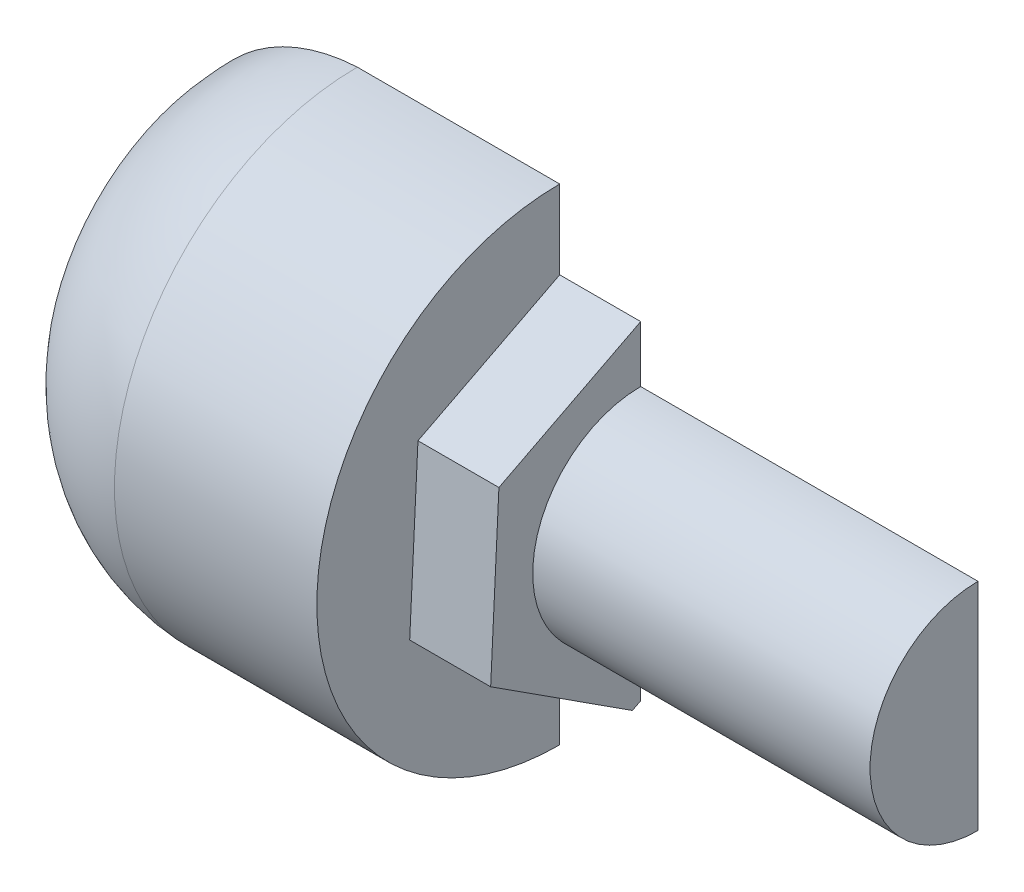
ISO-10303-21;
HEADER;
FILE_DESCRIPTION(('STEP AP214'),'2;1');
FILE_NAME('part.step','',(''),(''),'','','');
FILE_SCHEMA(('AUTOMOTIVE_DESIGN { 1 0 10303 214 1 1 1 1 }'));
ENDSEC;
DATA;
#1=APPLICATION_CONTEXT('core data for automotive mechanical design processes');
#2=APPLICATION_PROTOCOL_DEFINITION('international standard','automotive_design',2000,#1);
#3=PRODUCT_CONTEXT('',#1,'mechanical');
#4=PRODUCT('Part','Part','',(#3));
#5=PRODUCT_RELATED_PRODUCT_CATEGORY('part','',(#4));
#6=PRODUCT_DEFINITION_FORMATION('','',#4);
#7=PRODUCT_DEFINITION_CONTEXT('part definition',#1,'design');
#8=PRODUCT_DEFINITION('design','',#6,#7);
#9=PRODUCT_DEFINITION_SHAPE('','',#8);
#10=(LENGTH_UNIT() NAMED_UNIT(*) SI_UNIT(.MILLI.,.METRE.));
#11=(NAMED_UNIT(*) PLANE_ANGLE_UNIT() SI_UNIT($,.RADIAN.));
#12=(NAMED_UNIT(*) SI_UNIT($,.STERADIAN.) SOLID_ANGLE_UNIT());
#13=UNCERTAINTY_MEASURE_WITH_UNIT(LENGTH_MEASURE(1.E-05),#10,'distance_accuracy_value','');
#14=(GEOMETRIC_REPRESENTATION_CONTEXT(3) GLOBAL_UNCERTAINTY_ASSIGNED_CONTEXT((#13)) GLOBAL_UNIT_ASSIGNED_CONTEXT((#10,
#11,#12)) REPRESENTATION_CONTEXT('',''));
#15=CARTESIAN_POINT('',(0.,0.,0.));
#16=DIRECTION('',(0.,0.,1.));
#17=DIRECTION('',(1.,0.,0.));
#18=AXIS2_PLACEMENT_3D('',#15,#16,#17);
#19=CARTESIAN_POINT('',(0.,18.,0.));
#20=DIRECTION('',(-1.,0.,0.));
#21=DIRECTION('',(0.,0.,1.));
#22=AXIS2_PLACEMENT_3D('',#19,#20,#21);
#23=PLANE('',#22);
#24=DIRECTION('',(0.,-1.,0.));
#25=VECTOR('',#24,1.);
#26=CARTESIAN_POINT('',(0.,18.,0.));
#27=LINE('',#26,#25);
#28=CARTESIAN_POINT('',(0.,18.,0.));
#29=VERTEX_POINT('',#28);
#30=CARTESIAN_POINT('',(0.,12.1695229778633,0.));
#31=VERTEX_POINT('',#30);
#32=EDGE_CURVE('E209',#29,#31,#27,.T.);
#33=ORIENTED_EDGE('',*,*,#32,.F.);
#34=CARTESIAN_POINT('',(0.,0.,0.));
#35=DIRECTION('',(-1.,0.,0.));
#36=DIRECTION('',(0.,0.,1.));
#37=AXIS2_PLACEMENT_3D('',#34,#35,#36);
#38=CIRCLE('',#37,18.);
#39=CARTESIAN_POINT('',(0.,-18.,0.));
#40=VERTEX_POINT('',#39);
#41=EDGE_CURVE('E178',#40,#29,#38,.T.);
#42=ORIENTED_EDGE('',*,*,#41,.F.);
#43=CARTESIAN_POINT('',(0.,-12.1695229778633,0.));
#44=VERTEX_POINT('',#43);
#45=EDGE_CURVE('E225',#44,#40,#27,.T.);
#46=ORIENTED_EDGE('',*,*,#45,.F.);
#47=DIRECTION('',(0.,0.45690168699327,-0.889517199621628));
#48=VECTOR('',#47,1.);
#49=CARTESIAN_POINT('',(0.,-12.4845754630742,0.613358655387881));
#50=LINE('',#49,#48);
#51=CARTESIAN_POINT('',(0.,-12.4845754630742,0.613358655387879));
#52=VERTEX_POINT('',#51);
#53=EDGE_CURVE('E58',#52,#44,#50,.T.);
#54=ORIENTED_EDGE('',*,*,#53,.F.);
#55=DIRECTION('',(0.,-0.541893648478888,-0.840447067778952));
#56=VECTOR('',#55,1.);
#57=CARTESIAN_POINT('',(0.,-5.71110355434015,11.1186388341801));
#58=LINE('',#57,#56);
#59=CARTESIAN_POINT('',(0.,-5.71110355434015,11.1186388341801));
#60=VERTEX_POINT('',#59);
#61=EDGE_CURVE('E143',#60,#52,#58,.T.);
#62=ORIENTED_EDGE('',*,*,#61,.F.);
#63=DIRECTION('',(0.,-0.998795335472159,0.0490701318426758));
#64=VECTOR('',#63,1.);
#65=CARTESIAN_POINT('',(0.,6.77347190873408,10.5052801787922));
#66=LINE('',#65,#64);
#67=CARTESIAN_POINT('',(0.,6.77347190873408,10.5052801787922));
#68=VERTEX_POINT('',#67);
#69=EDGE_CURVE('E155',#68,#60,#66,.T.);
#70=ORIENTED_EDGE('',*,*,#69,.F.);
#71=DIRECTION('',(0.,-0.456901686993271,0.889517199621628));
#72=VECTOR('',#71,1.);
#73=CARTESIAN_POINT('',(0.,12.4845754630742,-0.613358655387877));
#74=LINE('',#73,#72);
#75=EDGE_CURVE('E164',#31,#68,#74,.T.);
#76=ORIENTED_EDGE('',*,*,#75,.F.);
#77=EDGE_LOOP('',(#33,#42,#46,#54,#62,#70,#76));
#78=FACE_BOUND('',#77,.T.);
#79=ADVANCED_FACE('F36',(#78),#23,.F.);
#80=CARTESIAN_POINT('',(-14.3013165100804,0.,0.));
#81=DIRECTION('',(-1.,0.,0.));
#82=DIRECTION('',(0.,0.,1.));
#83=AXIS2_PLACEMENT_3D('',#80,#81,#82);
#84=DEGENERATE_TOROIDAL_SURFACE('',#83,4.10263302016069,13.9149188855492,.T.);
#85=CARTESIAN_POINT('',(-14.3013165100804,-4.10263302016069,0.));
#86=DIRECTION('',(0.,0.,-1.));
#87=DIRECTION('',(-1.,0.,0.));
#88=AXIS2_PLACEMENT_3D('',#85,#86,#87);
#89=CIRCLE('',#88,13.9149188855492);
#90=CARTESIAN_POINT('',(-15.0000000000001,-18.,0.));
#91=VERTEX_POINT('',#90);
#92=CARTESIAN_POINT('',(-25.,-13.,0.));
#93=VERTEX_POINT('',#92);
#94=EDGE_CURVE('E201',#91,#93,#89,.T.);
#95=ORIENTED_EDGE('',*,*,#94,.F.);
#96=CARTESIAN_POINT('',(-15.0000000000001,0.,0.));
#97=DIRECTION('',(-1.,0.,0.));
#98=DIRECTION('',(0.,0.,1.));
#99=AXIS2_PLACEMENT_3D('',#96,#97,#98);
#100=CIRCLE('',#99,18.);
#101=CARTESIAN_POINT('',(-15.0000000000001,18.,0.));
#102=VERTEX_POINT('',#101);
#103=EDGE_CURVE('E175',#91,#102,#100,.T.);
#104=ORIENTED_EDGE('',*,*,#103,.T.);
#105=CARTESIAN_POINT('',(-14.3013165100804,4.10263302016069,0.));
#106=DIRECTION('',(0.,0.,-1.));
#107=DIRECTION('',(-1.,0.,0.));
#108=AXIS2_PLACEMENT_3D('',#105,#106,#107);
#109=CIRCLE('',#108,13.9149188855492);
#110=CARTESIAN_POINT('',(-25.,13.,0.));
#111=VERTEX_POINT('',#110);
#112=EDGE_CURVE('E203',#111,#102,#109,.T.);
#113=ORIENTED_EDGE('',*,*,#112,.F.);
#114=CARTESIAN_POINT('',(-25.,0.,0.));
#115=DIRECTION('',(-1.,0.,0.));
#116=DIRECTION('',(0.,0.,1.));
#117=AXIS2_PLACEMENT_3D('',#114,#115,#116);
#118=CIRCLE('',#117,13.);
#119=EDGE_CURVE('E150',#93,#111,#118,.T.);
#120=ORIENTED_EDGE('',*,*,#119,.F.);
#121=EDGE_LOOP('',(#95,#104,#113,#120));
#122=FACE_BOUND('',#121,.T.);
#123=ADVANCED_FACE('F38',(#122),#84,.T.);
#124=CARTESIAN_POINT('',(-25.,0.,0.));
#125=DIRECTION('',(-1.,0.,0.));
#126=DIRECTION('',(0.,0.,1.));
#127=AXIS2_PLACEMENT_3D('',#124,#125,#126);
#128=CONICAL_SURFACE('',#127,13.,1.00963291450654);
#129=DIRECTION('',(-0.53217154521835,-0.846636549211002,0.));
#130=VECTOR('',#129,1.);
#131=CARTESIAN_POINT('',(-16.8285714285714,0.,0.));
#132=LINE('',#131,#130);
#133=CARTESIAN_POINT('',(-23.9,-11.25,0.));
#134=VERTEX_POINT('',#133);
#135=EDGE_CURVE('E197',#93,#134,#132,.F.);
#136=ORIENTED_EDGE('',*,*,#135,.F.);
#137=ORIENTED_EDGE('',*,*,#119,.T.);
#138=DIRECTION('',(0.53217154521835,-0.846636549211002,0.));
#139=VECTOR('',#138,1.);
#140=CARTESIAN_POINT('',(-16.8285714285714,0.,0.));
#141=LINE('',#140,#139);
#142=CARTESIAN_POINT('',(-23.9,11.25,0.));
#143=VERTEX_POINT('',#142);
#144=EDGE_CURVE('E196',#143,#111,#141,.F.);
#145=ORIENTED_EDGE('',*,*,#144,.F.);
#146=CARTESIAN_POINT('',(-23.9,0.,0.));
#147=DIRECTION('',(-1.,0.,0.));
#148=DIRECTION('',(0.,0.,1.));
#149=AXIS2_PLACEMENT_3D('',#146,#147,#148);
#150=CIRCLE('',#149,11.25);
#151=EDGE_CURVE('E187',#134,#143,#150,.T.);
#152=ORIENTED_EDGE('',*,*,#151,.F.);
#153=EDGE_LOOP('',(#136,#137,#145,#152));
#154=FACE_BOUND('',#153,.T.);
#155=ADVANCED_FACE('F194',(#154),#128,.F.);
#156=CARTESIAN_POINT('',(-23.9,0.,0.));
#157=DIRECTION('',(-1.,0.,0.));
#158=DIRECTION('',(0.,0.,1.));
#159=AXIS2_PLACEMENT_3D('',#156,#157,#158);
#160=CONICAL_SURFACE('',#159,11.25,0.246558855786513);
#161=DIRECTION('',(-0.969758036063496,-0.244068333649149,0.));
#162=VECTOR('',#161,1.);
#163=CARTESIAN_POINT('',(20.799686119041,0.,0.));
#164=LINE('',#163,#162);
#165=CARTESIAN_POINT('',(-21.9133472835982,-10.75,0.));
#166=VERTEX_POINT('',#165);
#167=EDGE_CURVE('E220',#134,#166,#164,.F.);
#168=ORIENTED_EDGE('',*,*,#167,.F.);
#169=ORIENTED_EDGE('',*,*,#151,.T.);
#170=DIRECTION('',(0.969758036063496,-0.244068333649149,0.));
#171=VECTOR('',#170,1.);
#172=CARTESIAN_POINT('',(20.799686119041,0.,0.));
#173=LINE('',#172,#171);
#174=CARTESIAN_POINT('',(-21.9133472835982,10.75,0.));
#175=VERTEX_POINT('',#174);
#176=EDGE_CURVE('E207',#175,#143,#173,.F.);
#177=ORIENTED_EDGE('',*,*,#176,.F.);
#178=CARTESIAN_POINT('',(-21.9133472835982,0.,0.));
#179=DIRECTION('',(-1.,0.,0.));
#180=DIRECTION('',(0.,0.,1.));
#181=AXIS2_PLACEMENT_3D('',#178,#179,#180);
#182=CIRCLE('',#181,10.75);
#183=EDGE_CURVE('E184',#166,#175,#182,.T.);
#184=ORIENTED_EDGE('',*,*,#183,.F.);
#185=EDGE_LOOP('',(#168,#169,#177,#184));
#186=FACE_BOUND('',#185,.T.);
#187=ADVANCED_FACE('F279',(#186),#160,.F.);
#188=CARTESIAN_POINT('',(-13.8904755221231,0.,0.));
#189=DIRECTION('',(-1.,0.,0.));
#190=DIRECTION('',(0.,0.,1.));
#191=AXIS2_PLACEMENT_3D('',#188,#189,#190);
#192=DEGENERATE_TOROIDAL_SURFACE('',#191,0.657691053798667,13.9463933144018,.F.);
#193=CARTESIAN_POINT('',(-13.8904755221231,0.657691053798667,0.));
#194=DIRECTION('',(0.,0.,-1.));
#195=DIRECTION('',(-1.,0.,0.));
#196=AXIS2_PLACEMENT_3D('',#193,#194,#195);
#197=CIRCLE('',#196,13.9463933144018);
#198=CARTESIAN_POINT('',(-0.153484939413202,-1.74999999999787,0.));
#199=VERTEX_POINT('',#198);
#200=EDGE_CURVE('E218',#166,#199,#197,.F.);
#201=ORIENTED_EDGE('',*,*,#200,.F.);
#202=ORIENTED_EDGE('',*,*,#183,.T.);
#203=CARTESIAN_POINT('',(-13.8904755221231,-0.657691053798667,0.));
#204=DIRECTION('',(0.,0.,-1.));
#205=DIRECTION('',(-1.,0.,0.));
#206=AXIS2_PLACEMENT_3D('',#203,#204,#205);
#207=CIRCLE('',#206,13.9463933144018);
#208=CARTESIAN_POINT('',(-0.153484939413202,1.74999999999787,0.));
#209=VERTEX_POINT('',#208);
#210=EDGE_CURVE('E214',#209,#175,#207,.F.);
#211=ORIENTED_EDGE('',*,*,#210,.F.);
#212=CARTESIAN_POINT('',(-0.153484939413202,0.,0.));
#213=DIRECTION('',(-1.,0.,0.));
#214=DIRECTION('',(0.,0.,1.));
#215=AXIS2_PLACEMENT_3D('',#212,#213,#214);
#216=CIRCLE('',#215,1.74999999999787);
#217=EDGE_CURVE('E181',#199,#209,#216,.T.);
#218=ORIENTED_EDGE('',*,*,#217,.F.);
#219=EDGE_LOOP('',(#201,#202,#211,#218));
#220=FACE_BOUND('',#219,.T.);
#221=ADVANCED_FACE('F275',(#220),#192,.T.);
#222=CARTESIAN_POINT('',(-0.153484939413202,1.74999999999787,0.));
#223=DIRECTION('',(1.,0.,0.));
#224=DIRECTION('',(0.,0.,-1.));
#225=AXIS2_PLACEMENT_3D('',#222,#223,#224);
#226=PLANE('',#225);
#227=DIRECTION('',(0.,1.,0.));
#228=VECTOR('',#227,1.);
#229=CARTESIAN_POINT('',(-0.153484939413202,1.74999999999787,0.));
#230=LINE('',#229,#228);
#231=EDGE_CURVE('E216',#199,#209,#230,.T.);
#232=ORIENTED_EDGE('',*,*,#231,.F.);
#233=ORIENTED_EDGE('',*,*,#217,.T.);
#234=EDGE_LOOP('',(#232,#233));
#235=FACE_BOUND('',#234,.T.);
#236=ADVANCED_FACE('F263',(#235),#226,.F.);
#237=CARTESIAN_POINT('',(-0.153484939413202,0.,0.));
#238=DIRECTION('',(-1.,0.,0.));
#239=DIRECTION('',(0.,0.,1.));
#240=AXIS2_PLACEMENT_3D('',#237,#238,#239);
#241=CYLINDRICAL_SURFACE('',#240,18.);
#242=DIRECTION('',(-1.,0.,0.));
#243=VECTOR('',#242,1.);
#244=CARTESIAN_POINT('',(-0.153484939413202,-18.,0.));
#245=LINE('',#244,#243);
#246=EDGE_CURVE('E224',#40,#91,#245,.T.);
#247=ORIENTED_EDGE('',*,*,#246,.F.);
#248=ORIENTED_EDGE('',*,*,#41,.T.);
#249=DIRECTION('',(-1.,0.,0.));
#250=VECTOR('',#249,1.);
#251=CARTESIAN_POINT('',(-0.153484939413202,18.,0.));
#252=LINE('',#251,#250);
#253=EDGE_CURVE('E205',#102,#29,#252,.F.);
#254=ORIENTED_EDGE('',*,*,#253,.F.);
#255=ORIENTED_EDGE('',*,*,#103,.F.);
#256=EDGE_LOOP('',(#247,#248,#254,#255));
#257=FACE_BOUND('',#256,.T.);
#258=ADVANCED_FACE('F256',(#257),#241,.T.);
#259=CARTESIAN_POINT('',(6.,-12.4845754630742,0.613358655387881));
#260=DIRECTION('',(0.,0.889517199621628,0.45690168699327));
#261=DIRECTION('',(0.,-0.45690168699327,0.889517199621628));
#262=AXIS2_PLACEMENT_3D('',#259,#260,#261);
#263=PLANE('',#262);
#264=DIRECTION('',(-1.,0.,0.));
#265=VECTOR('',#264,1.);
#266=CARTESIAN_POINT('',(6.,-12.1695229778633,0.));
#267=LINE('',#266,#265);
#268=CARTESIAN_POINT('',(6.,-12.1695229778633,0.));
#269=VERTEX_POINT('',#268);
#270=EDGE_CURVE('E226',#269,#44,#267,.T.);
#271=ORIENTED_EDGE('',*,*,#270,.F.);
#272=DIRECTION('',(0.,0.45690168699327,-0.889517199621628));
#273=VECTOR('',#272,1.);
#274=CARTESIAN_POINT('',(6.,-12.4845754630742,0.613358655387881));
#275=LINE('',#274,#273);
#276=CARTESIAN_POINT('',(6.,-12.4845754630742,0.613358655387881));
#277=VERTEX_POINT('',#276);
#278=EDGE_CURVE('E154',#277,#269,#275,.T.);
#279=ORIENTED_EDGE('',*,*,#278,.F.);
#280=DIRECTION('',(-1.,0.,0.));
#281=VECTOR('',#280,1.);
#282=CARTESIAN_POINT('',(6.,-12.4845754630742,0.613358655387881));
#283=LINE('',#282,#281);
#284=EDGE_CURVE('E173',#277,#52,#283,.T.);
#285=ORIENTED_EDGE('',*,*,#284,.T.);
#286=ORIENTED_EDGE('',*,*,#53,.T.);
#287=EDGE_LOOP('',(#271,#279,#285,#286));
#288=FACE_BOUND('',#287,.T.);
#289=ADVANCED_FACE('F254',(#288),#263,.F.);
#290=CARTESIAN_POINT('',(6.,12.4845754630742,-0.613358655387877));
#291=DIRECTION('',(0.,-0.889517199621628,-0.45690168699327));
#292=DIRECTION('',(0.,0.456901686993271,-0.889517199621628));
#293=AXIS2_PLACEMENT_3D('',#290,#291,#292);
#294=PLANE('',#293);
#295=DIRECTION('',(1.,0.,0.));
#296=VECTOR('',#295,1.);
#297=CARTESIAN_POINT('',(6.,12.1695229778633,0.));
#298=LINE('',#297,#296);
#299=CARTESIAN_POINT('',(6.,12.1695229778633,0.));
#300=VERTEX_POINT('',#299);
#301=EDGE_CURVE('E232',#31,#300,#298,.T.);
#302=ORIENTED_EDGE('',*,*,#301,.F.);
#303=ORIENTED_EDGE('',*,*,#75,.T.);
#304=DIRECTION('',(-1.,0.,0.));
#305=VECTOR('',#304,1.);
#306=CARTESIAN_POINT('',(6.,6.77347190873408,10.5052801787922));
#307=LINE('',#306,#305);
#308=CARTESIAN_POINT('',(6.,6.77347190873408,10.5052801787922));
#309=VERTEX_POINT('',#308);
#310=EDGE_CURVE('E170',#309,#68,#307,.T.);
#311=ORIENTED_EDGE('',*,*,#310,.F.);
#312=DIRECTION('',(0.,-0.456901686993271,0.889517199621628));
#313=VECTOR('',#312,1.);
#314=CARTESIAN_POINT('',(6.,12.4845754630742,-0.613358655387877));
#315=LINE('',#314,#313);
#316=EDGE_CURVE('E158',#300,#309,#315,.T.);
#317=ORIENTED_EDGE('',*,*,#316,.F.);
#318=EDGE_LOOP('',(#302,#303,#311,#317));
#319=FACE_BOUND('',#318,.T.);
#320=ADVANCED_FACE('F242',(#319),#294,.F.);
#321=CARTESIAN_POINT('',(6.,0.,0.));
#322=DIRECTION('',(1.,0.,0.));
#323=DIRECTION('',(0.,0.,-1.));
#324=AXIS2_PLACEMENT_3D('',#321,#322,#323);
#325=PLANE('',#324);
#326=ORIENTED_EDGE('',*,*,#278,.T.);
#327=DIRECTION('',(0.,1.,0.));
#328=VECTOR('',#327,1.);
#329=CARTESIAN_POINT('',(6.,0.,0.));
#330=LINE('',#329,#328);
#331=CARTESIAN_POINT('',(6.,-8.,0.));
#332=VERTEX_POINT('',#331);
#333=EDGE_CURVE('E140',#269,#332,#330,.T.);
#334=ORIENTED_EDGE('',*,*,#333,.T.);
#335=CARTESIAN_POINT('',(6.,0.,0.));
#336=DIRECTION('',(1.,0.,0.));
#337=DIRECTION('',(0.,0.,-1.));
#338=AXIS2_PLACEMENT_3D('',#335,#336,#337);
#339=CIRCLE('',#338,8.);
#340=CARTESIAN_POINT('',(6.,8.,0.));
#341=VERTEX_POINT('',#340);
#342=EDGE_CURVE('E44',#341,#332,#339,.T.);
#343=ORIENTED_EDGE('',*,*,#342,.F.);
#344=EDGE_CURVE('E229',#341,#300,#330,.T.);
#345=ORIENTED_EDGE('',*,*,#344,.T.);
#346=ORIENTED_EDGE('',*,*,#316,.T.);
#347=DIRECTION('',(0.,-0.998795335472159,0.0490701318426758));
#348=VECTOR('',#347,1.);
#349=CARTESIAN_POINT('',(6.,6.77347190873408,10.5052801787922));
#350=LINE('',#349,#348);
#351=CARTESIAN_POINT('',(6.,-5.71110355434015,11.1186388341801));
#352=VERTEX_POINT('',#351);
#353=EDGE_CURVE('E160',#309,#352,#350,.T.);
#354=ORIENTED_EDGE('',*,*,#353,.T.);
#355=DIRECTION('',(0.,-0.541893648478888,-0.840447067778952));
#356=VECTOR('',#355,1.);
#357=CARTESIAN_POINT('',(6.,-5.71110355434015,11.1186388341801));
#358=LINE('',#357,#356);
#359=EDGE_CURVE('E151',#352,#277,#358,.T.);
#360=ORIENTED_EDGE('',*,*,#359,.T.);
#361=EDGE_LOOP('',(#326,#334,#343,#345,#346,#354,#360));
#362=FACE_BOUND('',#361,.T.);
#363=ADVANCED_FACE('F239',(#362),#325,.T.);
#364=CARTESIAN_POINT('',(31.,0.,0.));
#365=DIRECTION('',(-1.,0.,0.));
#366=DIRECTION('',(0.,0.,1.));
#367=AXIS2_PLACEMENT_3D('',#364,#365,#366);
#368=CYLINDRICAL_SURFACE('',#367,8.);
#369=DIRECTION('',(-1.,0.,0.));
#370=VECTOR('',#369,1.);
#371=CARTESIAN_POINT('',(31.,-8.,0.));
#372=LINE('',#371,#370);
#373=CARTESIAN_POINT('',(31.,-8.,0.));
#374=VERTEX_POINT('',#373);
#375=EDGE_CURVE('E130',#374,#332,#372,.T.);
#376=ORIENTED_EDGE('',*,*,#375,.F.);
#377=CARTESIAN_POINT('',(31.,0.,0.));
#378=DIRECTION('',(1.,0.,0.));
#379=DIRECTION('',(0.,0.,-1.));
#380=AXIS2_PLACEMENT_3D('',#377,#378,#379);
#381=CIRCLE('',#380,8.);
#382=CARTESIAN_POINT('',(31.,8.,0.));
#383=VERTEX_POINT('',#382);
#384=EDGE_CURVE('E138',#383,#374,#381,.T.);
#385=ORIENTED_EDGE('',*,*,#384,.F.);
#386=DIRECTION('',(-1.,0.,0.));
#387=VECTOR('',#386,1.);
#388=CARTESIAN_POINT('',(31.,8.,0.));
#389=LINE('',#388,#387);
#390=EDGE_CURVE('E51',#341,#383,#389,.F.);
#391=ORIENTED_EDGE('',*,*,#390,.F.);
#392=ORIENTED_EDGE('',*,*,#342,.T.);
#393=EDGE_LOOP('',(#376,#385,#391,#392));
#394=FACE_BOUND('',#393,.T.);
#395=ADVANCED_FACE('F137',(#394),#368,.T.);
#396=CARTESIAN_POINT('',(31.,0.,0.));
#397=DIRECTION('',(1.,0.,0.));
#398=DIRECTION('',(0.,0.,-1.));
#399=AXIS2_PLACEMENT_3D('',#396,#397,#398);
#400=PLANE('',#399);
#401=ORIENTED_EDGE('',*,*,#384,.T.);
#402=DIRECTION('',(0.,1.,0.));
#403=VECTOR('',#402,1.);
#404=CARTESIAN_POINT('',(31.,0.,0.));
#405=LINE('',#404,#403);
#406=EDGE_CURVE('E11',#374,#383,#405,.T.);
#407=ORIENTED_EDGE('',*,*,#406,.T.);
#408=EDGE_LOOP('',(#401,#407));
#409=FACE_BOUND('',#408,.T.);
#410=ADVANCED_FACE('F142',(#409),#400,.T.);
#411=CARTESIAN_POINT('',(6.,-5.71110355434015,11.1186388341801));
#412=DIRECTION('',(0.,0.840447067778952,-0.541893648478889));
#413=DIRECTION('',(0.,0.541893648478889,0.840447067778952));
#414=AXIS2_PLACEMENT_3D('',#411,#412,#413);
#415=PLANE('',#414);
#416=ORIENTED_EDGE('',*,*,#61,.T.);
#417=ORIENTED_EDGE('',*,*,#284,.F.);
#418=ORIENTED_EDGE('',*,*,#359,.F.);
#419=DIRECTION('',(-1.,0.,0.));
#420=VECTOR('',#419,1.);
#421=CARTESIAN_POINT('',(6.,-5.71110355434015,11.1186388341801));
#422=LINE('',#421,#420);
#423=EDGE_CURVE('E161',#352,#60,#422,.T.);
#424=ORIENTED_EDGE('',*,*,#423,.T.);
#425=EDGE_LOOP('',(#416,#417,#418,#424));
#426=FACE_BOUND('',#425,.T.);
#427=ADVANCED_FACE('F252',(#426),#415,.F.);
#428=CARTESIAN_POINT('',(6.,6.77347190873408,10.5052801787922));
#429=DIRECTION('',(0.,-0.0490701318426758,-0.998795335472159));
#430=DIRECTION('',(0.,0.998795335472159,-0.0490701318426758));
#431=AXIS2_PLACEMENT_3D('',#428,#429,#430);
#432=PLANE('',#431);
#433=ORIENTED_EDGE('',*,*,#69,.T.);
#434=ORIENTED_EDGE('',*,*,#423,.F.);
#435=ORIENTED_EDGE('',*,*,#353,.F.);
#436=ORIENTED_EDGE('',*,*,#310,.T.);
#437=EDGE_LOOP('',(#433,#434,#435,#436));
#438=FACE_BOUND('',#437,.T.);
#439=ADVANCED_FACE('F248',(#438),#432,.F.);
#440=CARTESIAN_POINT('',(-36.,0.,0.));
#441=DIRECTION('',(0.,0.,-1.));
#442=DIRECTION('',(-1.,0.,0.));
#443=AXIS2_PLACEMENT_3D('',#440,#441,#442);
#444=PLANE('',#443);
#445=ORIENTED_EDGE('',*,*,#375,.T.);
#446=ORIENTED_EDGE('',*,*,#333,.F.);
#447=ORIENTED_EDGE('',*,*,#270,.T.);
#448=ORIENTED_EDGE('',*,*,#45,.T.);
#449=ORIENTED_EDGE('',*,*,#246,.T.);
#450=ORIENTED_EDGE('',*,*,#94,.T.);
#451=ORIENTED_EDGE('',*,*,#135,.T.);
#452=ORIENTED_EDGE('',*,*,#167,.T.);
#453=ORIENTED_EDGE('',*,*,#200,.T.);
#454=ORIENTED_EDGE('',*,*,#231,.T.);
#455=ORIENTED_EDGE('',*,*,#210,.T.);
#456=ORIENTED_EDGE('',*,*,#176,.T.);
#457=ORIENTED_EDGE('',*,*,#144,.T.);
#458=ORIENTED_EDGE('',*,*,#112,.T.);
#459=ORIENTED_EDGE('',*,*,#253,.T.);
#460=ORIENTED_EDGE('',*,*,#32,.T.);
#461=ORIENTED_EDGE('',*,*,#301,.T.);
#462=ORIENTED_EDGE('',*,*,#344,.F.);
#463=ORIENTED_EDGE('',*,*,#390,.T.);
#464=ORIENTED_EDGE('',*,*,#406,.F.);
#465=EDGE_LOOP('',(#445,#446,#447,#448,#449,#450,#451,#452,#453,#454,#455,#456,#457,#458,#459,
#460,#461,#462,#463,#464));
#466=FACE_BOUND('',#465,.T.);
#467=ADVANCED_FACE('F129',(#466),#444,.T.);
#468=CLOSED_SHELL('',(#79,#123,#155,#187,#221,#236,#258,#289,#320,#363,#395,#410,#427,#439,#467));
#469=MANIFOLD_SOLID_BREP('B2',#468);
#470=ADVANCED_BREP_SHAPE_REPRESENTATION('',(#18,#469),#14);
#471=SHAPE_DEFINITION_REPRESENTATION(#9,#470);
ENDSEC;
END-ISO-10303-21;
